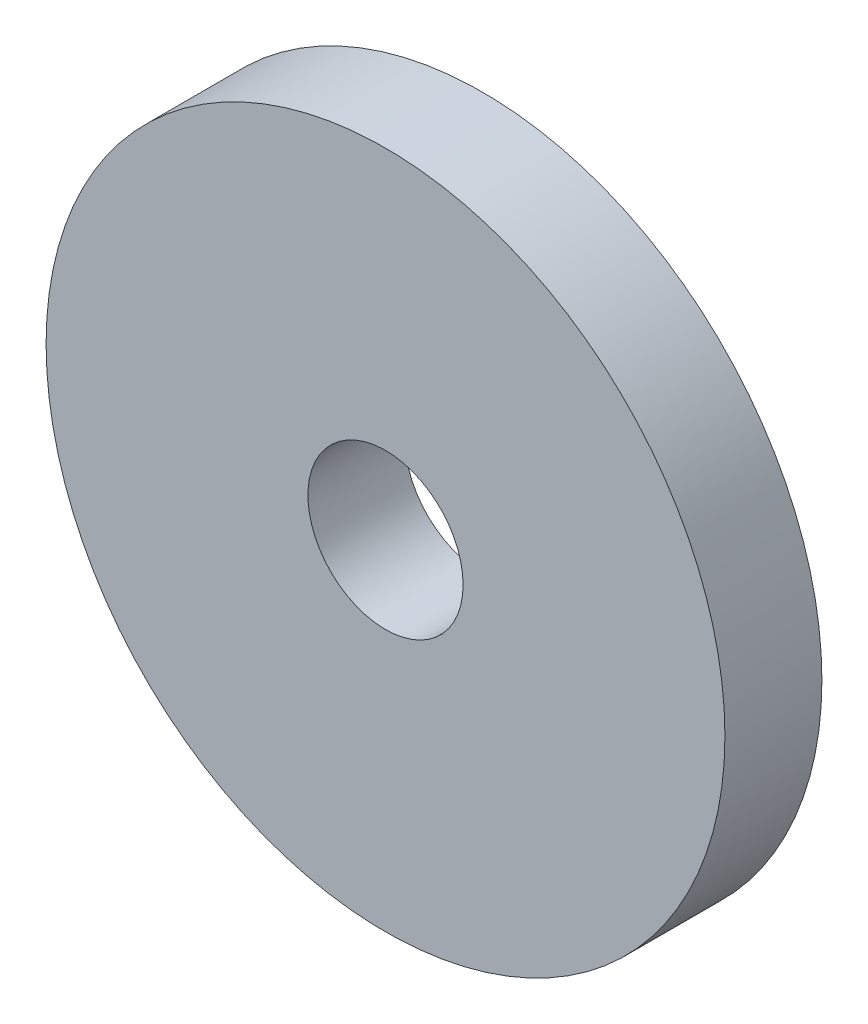
ISO-10303-21;
HEADER;
FILE_DESCRIPTION(('STEP AP214'),'2;1');
FILE_NAME('part.step','',(''),(''),'','','');
FILE_SCHEMA(('AUTOMOTIVE_DESIGN { 1 0 10303 214 1 1 1 1 }'));
ENDSEC;
DATA;
#1=APPLICATION_CONTEXT('core data for automotive mechanical design processes');
#2=APPLICATION_PROTOCOL_DEFINITION('international standard','automotive_design',2000,#1);
#3=PRODUCT_CONTEXT('',#1,'mechanical');
#4=PRODUCT('Part','Part','',(#3));
#5=PRODUCT_RELATED_PRODUCT_CATEGORY('part','',(#4));
#6=PRODUCT_DEFINITION_FORMATION('','',#4);
#7=PRODUCT_DEFINITION_CONTEXT('part definition',#1,'design');
#8=PRODUCT_DEFINITION('design','',#6,#7);
#9=PRODUCT_DEFINITION_SHAPE('','',#8);
#10=(LENGTH_UNIT() NAMED_UNIT(*) SI_UNIT(.MILLI.,.METRE.));
#11=(NAMED_UNIT(*) PLANE_ANGLE_UNIT() SI_UNIT($,.RADIAN.));
#12=(NAMED_UNIT(*) SI_UNIT($,.STERADIAN.) SOLID_ANGLE_UNIT());
#13=UNCERTAINTY_MEASURE_WITH_UNIT(LENGTH_MEASURE(1.E-05),#10,'distance_accuracy_value','');
#14=(GEOMETRIC_REPRESENTATION_CONTEXT(3) GLOBAL_UNCERTAINTY_ASSIGNED_CONTEXT((#13)) GLOBAL_UNIT_ASSIGNED_CONTEXT((#10,
#11,#12)) REPRESENTATION_CONTEXT('',''));
#15=CARTESIAN_POINT('',(0.,0.,0.));
#16=DIRECTION('',(0.,0.,1.));
#17=DIRECTION('',(1.,0.,0.));
#18=AXIS2_PLACEMENT_3D('',#15,#16,#17);
#19=CARTESIAN_POINT('',(0.,0.,34.));
#20=DIRECTION('',(0.,0.,1.));
#21=DIRECTION('',(1.,0.,0.));
#22=AXIS2_PLACEMENT_3D('',#19,#20,#21);
#23=PLANE('',#22);
#24=CARTESIAN_POINT('',(0.,0.,34.));
#25=DIRECTION('',(0.,0.,1.));
#26=DIRECTION('',(1.,0.,0.));
#27=AXIS2_PLACEMENT_3D('',#24,#25,#26);
#28=CIRCLE('',#27,52.5);
#29=CARTESIAN_POINT('',(52.5,0.,34.));
#30=VERTEX_POINT('',#29);
#31=EDGE_CURVE('E10',#30,#30,#28,.T.);
#32=ORIENTED_EDGE('',*,*,#31,.T.);
#33=EDGE_LOOP('',(#32));
#34=FACE_BOUND('',#33,.T.);
#35=CARTESIAN_POINT('',(0.,0.,34.));
#36=DIRECTION('',(0.,0.,1.));
#37=DIRECTION('',(1.,0.,0.));
#38=AXIS2_PLACEMENT_3D('',#35,#36,#37);
#39=CIRCLE('',#38,12.);
#40=CARTESIAN_POINT('',(12.,0.,34.));
#41=VERTEX_POINT('',#40);
#42=EDGE_CURVE('E43',#41,#41,#39,.T.);
#43=ORIENTED_EDGE('',*,*,#42,.F.);
#44=EDGE_LOOP('',(#43));
#45=FACE_BOUND('',#44,.T.);
#46=ADVANCED_FACE('F32',(#34,#45),#23,.T.);
#47=CARTESIAN_POINT('',(0.,0.,19.));
#48=DIRECTION('',(0.,0.,1.));
#49=DIRECTION('',(1.,0.,0.));
#50=AXIS2_PLACEMENT_3D('',#47,#48,#49);
#51=PLANE('',#50);
#52=CARTESIAN_POINT('',(0.,0.,19.));
#53=DIRECTION('',(0.,0.,1.));
#54=DIRECTION('',(1.,0.,0.));
#55=AXIS2_PLACEMENT_3D('',#52,#53,#54);
#56=CIRCLE('',#55,52.5);
#57=CARTESIAN_POINT('',(52.5,0.,19.));
#58=VERTEX_POINT('',#57);
#59=EDGE_CURVE('E36',#58,#58,#56,.T.);
#60=ORIENTED_EDGE('',*,*,#59,.F.);
#61=EDGE_LOOP('',(#60));
#62=FACE_BOUND('',#61,.T.);
#63=CARTESIAN_POINT('',(0.,0.,19.));
#64=DIRECTION('',(0.,0.,1.));
#65=DIRECTION('',(1.,0.,0.));
#66=AXIS2_PLACEMENT_3D('',#63,#64,#65);
#67=CIRCLE('',#66,12.);
#68=CARTESIAN_POINT('',(12.,0.,19.));
#69=VERTEX_POINT('',#68);
#70=EDGE_CURVE('E45',#69,#69,#67,.T.);
#71=ORIENTED_EDGE('',*,*,#70,.T.);
#72=EDGE_LOOP('',(#71));
#73=FACE_BOUND('',#72,.T.);
#74=ADVANCED_FACE('F55',(#62,#73),#51,.F.);
#75=CARTESIAN_POINT('',(0.,0.,34.));
#76=DIRECTION('',(0.,0.,-1.));
#77=DIRECTION('',(-1.,0.,0.));
#78=AXIS2_PLACEMENT_3D('',#75,#76,#77);
#79=CYLINDRICAL_SURFACE('',#78,52.5);
#80=ORIENTED_EDGE('',*,*,#31,.F.);
#81=EDGE_LOOP('',(#80));
#82=FACE_BOUND('',#81,.T.);
#83=ORIENTED_EDGE('',*,*,#59,.T.);
#84=EDGE_LOOP('',(#83));
#85=FACE_BOUND('',#84,.T.);
#86=ADVANCED_FACE('F34',(#82,#85),#79,.T.);
#87=CARTESIAN_POINT('',(0.,0.,34.));
#88=DIRECTION('',(0.,0.,-1.));
#89=DIRECTION('',(-1.,0.,0.));
#90=AXIS2_PLACEMENT_3D('',#87,#88,#89);
#91=CYLINDRICAL_SURFACE('',#90,12.);
#92=ORIENTED_EDGE('',*,*,#42,.T.);
#93=EDGE_LOOP('',(#92));
#94=FACE_BOUND('',#93,.T.);
#95=ORIENTED_EDGE('',*,*,#70,.F.);
#96=EDGE_LOOP('',(#95));
#97=FACE_BOUND('',#96,.T.);
#98=ADVANCED_FACE('F51',(#94,#97),#91,.F.);
#99=CLOSED_SHELL('',(#46,#74,#86,#98));
#100=MANIFOLD_SOLID_BREP('B2',#99);
#101=ADVANCED_BREP_SHAPE_REPRESENTATION('',(#18,#100),#14);
#102=SHAPE_DEFINITION_REPRESENTATION(#9,#101);
ENDSEC;
END-ISO-10303-21;
